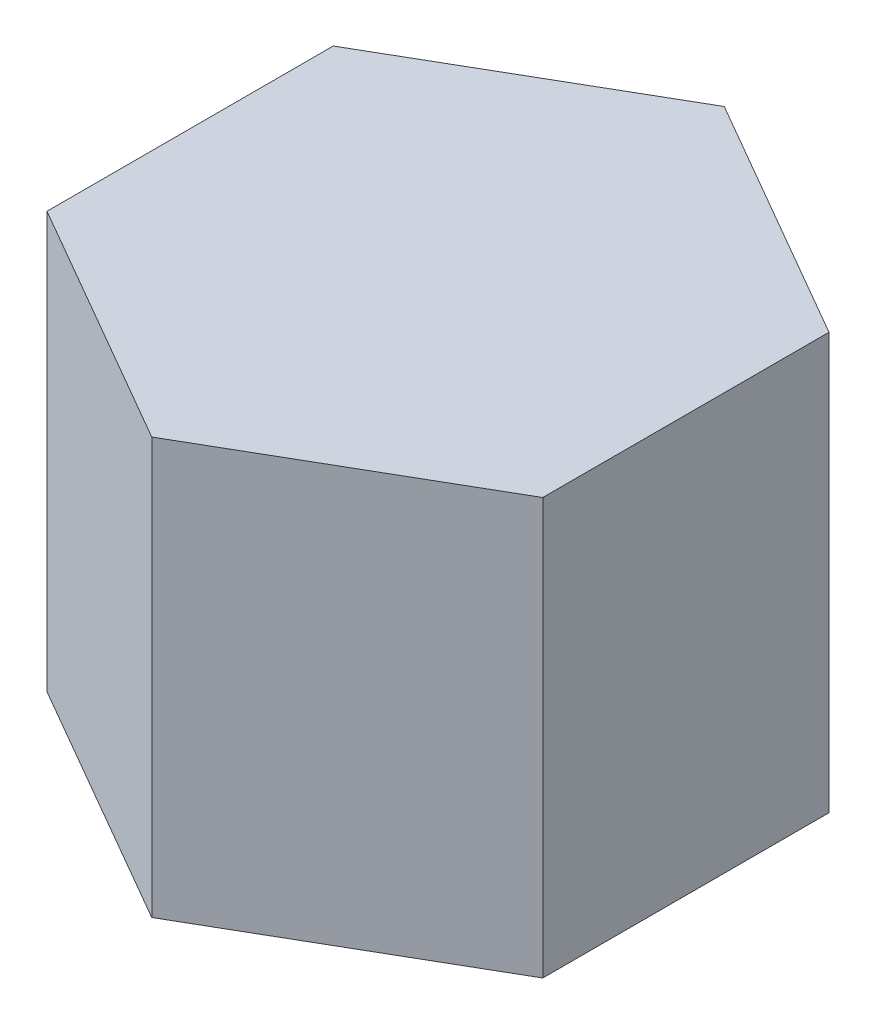
ISO-10303-21;
HEADER;
FILE_DESCRIPTION(('STEP AP214'),'2;1');
FILE_NAME('part.step','',(''),(''),'','','');
FILE_SCHEMA(('AUTOMOTIVE_DESIGN { 1 0 10303 214 1 1 1 1 }'));
ENDSEC;
DATA;
#1=APPLICATION_CONTEXT('core data for automotive mechanical design processes');
#2=APPLICATION_PROTOCOL_DEFINITION('international standard','automotive_design',2000,#1);
#3=PRODUCT_CONTEXT('',#1,'mechanical');
#4=PRODUCT('Part','Part','',(#3));
#5=PRODUCT_RELATED_PRODUCT_CATEGORY('part','',(#4));
#6=PRODUCT_DEFINITION_FORMATION('','',#4);
#7=PRODUCT_DEFINITION_CONTEXT('part definition',#1,'design');
#8=PRODUCT_DEFINITION('design','',#6,#7);
#9=PRODUCT_DEFINITION_SHAPE('','',#8);
#10=(LENGTH_UNIT() NAMED_UNIT(*) SI_UNIT(.MILLI.,.METRE.));
#11=(NAMED_UNIT(*) PLANE_ANGLE_UNIT() SI_UNIT($,.RADIAN.));
#12=(NAMED_UNIT(*) SI_UNIT($,.STERADIAN.) SOLID_ANGLE_UNIT());
#13=UNCERTAINTY_MEASURE_WITH_UNIT(LENGTH_MEASURE(1.E-05),#10,'distance_accuracy_value','');
#14=(GEOMETRIC_REPRESENTATION_CONTEXT(3) GLOBAL_UNCERTAINTY_ASSIGNED_CONTEXT((#13)) GLOBAL_UNIT_ASSIGNED_CONTEXT((#10,
#11,#12)) REPRESENTATION_CONTEXT('',''));
#15=CARTESIAN_POINT('',(0.,0.,0.));
#16=DIRECTION('',(0.,0.,1.));
#17=DIRECTION('',(1.,0.,0.));
#18=AXIS2_PLACEMENT_3D('',#15,#16,#17);
#19=CARTESIAN_POINT('',(202.839551417382,-147.556598747966,289.083895009141));
#20=DIRECTION('',(-0.499999999999943,0.,-0.866025403784471));
#21=DIRECTION('',(-0.866025403784471,0.,0.499999999999943));
#22=AXIS2_PLACEMENT_3D('',#19,#20,#21);
#23=PLANE('',#22);
#24=CARTESIAN_POINT('',(203.142660308706,-147.047793579175,288.908895009141));
#25=DIRECTION('',(-0.866025403784471,0.,0.499999999999943));
#26=VECTOR('',#25,1.);
#27=LINE('',#24,#26);
#28=CARTESIAN_POINT('',(203.142660308706,-147.047793579175,288.908895009141));
#29=VERTEX_POINT('',#28);
#30=CARTESIAN_POINT('',(202.839551417382,-147.047793579175,289.083895009141));
#31=VERTEX_POINT('',#30);
#32=EDGE_CURVE('E170',#29,#31,#27,.T.);
#33=ORIENTED_EDGE('',*,*,#32,.T.);
#34=CARTESIAN_POINT('',(202.839551417382,-147.556598747966,289.083895009141));
#35=DIRECTION('',(0.,1.,0.));
#36=VECTOR('',#35,1.);
#37=LINE('',#34,#36);
#38=CARTESIAN_POINT('',(202.839551417382,-147.556598747966,289.083895009141));
#39=VERTEX_POINT('',#38);
#40=EDGE_CURVE('E35',#39,#31,#37,.T.);
#41=ORIENTED_EDGE('',*,*,#40,.F.);
#42=CARTESIAN_POINT('',(203.142660308706,-147.556598747966,288.908895009141));
#43=DIRECTION('',(-0.866025403784471,0.,0.499999999999943));
#44=VECTOR('',#43,1.);
#45=LINE('',#42,#44);
#46=CARTESIAN_POINT('',(203.142660308706,-147.556598747966,288.908895009141));
#47=VERTEX_POINT('',#46);
#48=EDGE_CURVE('E159',#47,#39,#45,.T.);
#49=ORIENTED_EDGE('',*,*,#48,.F.);
#50=CARTESIAN_POINT('',(203.142660308706,-147.556598747966,288.908895009141));
#51=DIRECTION('',(0.,1.,0.));
#52=VECTOR('',#51,1.);
#53=LINE('',#50,#52);
#54=EDGE_CURVE('E10',#47,#29,#53,.T.);
#55=ORIENTED_EDGE('',*,*,#54,.T.);
#56=EDGE_LOOP('',(#33,#41,#49,#55));
#57=FACE_BOUND('',#56,.T.);
#58=ADVANCED_FACE('F16',(#57),#23,.F.);
#59=CARTESIAN_POINT('',(203.142660308706,-147.556598747966,291.594471220494));
#60=DIRECTION('',(-1.,0.,0.));
#61=DIRECTION('',(0.,-1.,0.));
#62=AXIS2_PLACEMENT_3D('',#59,#60,#61);
#63=PLANE('',#62);
#64=CARTESIAN_POINT('',(203.142660308706,-147.047793579175,288.558895009141));
#65=DIRECTION('',(0.,0.,1.));
#66=VECTOR('',#65,1.);
#67=LINE('',#64,#66);
#68=CARTESIAN_POINT('',(203.142660308706,-147.047793579175,288.558895009141));
#69=VERTEX_POINT('',#68);
#70=EDGE_CURVE('E167',#69,#29,#67,.T.);
#71=ORIENTED_EDGE('',*,*,#70,.T.);
#72=ORIENTED_EDGE('',*,*,#54,.F.);
#73=CARTESIAN_POINT('',(203.142660308706,-147.556598747966,288.558895009141));
#74=DIRECTION('',(0.,0.,1.));
#75=VECTOR('',#74,1.);
#76=LINE('',#73,#75);
#77=CARTESIAN_POINT('',(203.142660308706,-147.556598747966,288.558895009141));
#78=VERTEX_POINT('',#77);
#79=EDGE_CURVE('E156',#78,#47,#76,.T.);
#80=ORIENTED_EDGE('',*,*,#79,.F.);
#81=CARTESIAN_POINT('',(203.142660308706,-147.556598747966,288.558895009141));
#82=DIRECTION('',(0.,1.,0.));
#83=VECTOR('',#82,1.);
#84=LINE('',#81,#83);
#85=EDGE_CURVE('E27',#78,#69,#84,.T.);
#86=ORIENTED_EDGE('',*,*,#85,.T.);
#87=EDGE_LOOP('',(#71,#72,#80,#86));
#88=FACE_BOUND('',#87,.T.);
#89=ADVANCED_FACE('F189',(#88),#63,.F.);
#90=CARTESIAN_POINT('',(203.142660308706,-147.556598747966,288.558895009141));
#91=DIRECTION('',(-0.499999999999978,0.,0.866025403784452));
#92=DIRECTION('',(0.866025403784452,0.,0.499999999999978));
#93=AXIS2_PLACEMENT_3D('',#90,#91,#92);
#94=PLANE('',#93);
#95=CARTESIAN_POINT('',(202.839551417382,-147.047793579175,288.383895009141));
#96=DIRECTION('',(0.866025403784452,0.,0.499999999999978));
#97=VECTOR('',#96,1.);
#98=LINE('',#95,#97);
#99=CARTESIAN_POINT('',(202.839551417382,-147.047793579175,288.383895009141));
#100=VERTEX_POINT('',#99);
#101=EDGE_CURVE('E163',#100,#69,#98,.T.);
#102=ORIENTED_EDGE('',*,*,#101,.T.);
#103=ORIENTED_EDGE('',*,*,#85,.F.);
#104=CARTESIAN_POINT('',(202.839551417382,-147.556598747966,288.383895009141));
#105=DIRECTION('',(0.866025403784452,0.,0.499999999999978));
#106=VECTOR('',#105,1.);
#107=LINE('',#104,#106);
#108=CARTESIAN_POINT('',(202.839551417382,-147.556598747966,288.383895009141));
#109=VERTEX_POINT('',#108);
#110=EDGE_CURVE('E106',#109,#78,#107,.T.);
#111=ORIENTED_EDGE('',*,*,#110,.F.);
#112=CARTESIAN_POINT('',(202.839551417382,-147.556598747966,288.383895009141));
#113=DIRECTION('',(0.,1.,0.));
#114=VECTOR('',#113,1.);
#115=LINE('',#112,#114);
#116=EDGE_CURVE('E94',#109,#100,#115,.T.);
#117=ORIENTED_EDGE('',*,*,#116,.T.);
#118=EDGE_LOOP('',(#102,#103,#111,#117));
#119=FACE_BOUND('',#118,.T.);
#120=ADVANCED_FACE('F198',(#119),#94,.F.);
#121=CARTESIAN_POINT('',(202.839551417382,-147.556598747966,288.383895009141));
#122=DIRECTION('',(0.499999999999978,0.,0.866025403784452));
#123=DIRECTION('',(0.866025403784452,0.,-0.499999999999978));
#124=AXIS2_PLACEMENT_3D('',#121,#122,#123);
#125=PLANE('',#124);
#126=CARTESIAN_POINT('',(202.536442526057,-147.047793579175,288.558895009141));
#127=DIRECTION('',(0.866025403784452,0.,-0.499999999999978));
#128=VECTOR('',#127,1.);
#129=LINE('',#126,#128);
#130=CARTESIAN_POINT('',(202.536442526057,-147.047793579175,288.558895009141));
#131=VERTEX_POINT('',#130);
#132=EDGE_CURVE('E162',#131,#100,#129,.T.);
#133=ORIENTED_EDGE('',*,*,#132,.T.);
#134=ORIENTED_EDGE('',*,*,#116,.F.);
#135=CARTESIAN_POINT('',(202.536442526057,-147.556598747966,288.558895009141));
#136=DIRECTION('',(0.866025403784452,0.,-0.499999999999978));
#137=VECTOR('',#136,1.);
#138=LINE('',#135,#137);
#139=CARTESIAN_POINT('',(202.536442526057,-147.556598747966,288.558895009141));
#140=VERTEX_POINT('',#139);
#141=EDGE_CURVE('E98',#140,#109,#138,.T.);
#142=ORIENTED_EDGE('',*,*,#141,.F.);
#143=CARTESIAN_POINT('',(202.536442526057,-147.556598747966,288.558895009141));
#144=DIRECTION('',(0.,1.,0.));
#145=VECTOR('',#144,1.);
#146=LINE('',#143,#145);
#147=EDGE_CURVE('E79',#140,#131,#146,.T.);
#148=ORIENTED_EDGE('',*,*,#147,.T.);
#149=EDGE_LOOP('',(#133,#134,#142,#148));
#150=FACE_BOUND('',#149,.T.);
#151=ADVANCED_FACE('F100',(#150),#125,.F.);
#152=CARTESIAN_POINT('',(202.536442526057,-147.556598747966,291.594471220494));
#153=DIRECTION('',(1.,0.,0.));
#154=DIRECTION('',(0.,1.,0.));
#155=AXIS2_PLACEMENT_3D('',#152,#153,#154);
#156=PLANE('',#155);
#157=CARTESIAN_POINT('',(202.536442526057,-147.047793579175,288.908895009141));
#158=DIRECTION('',(0.,0.,-1.));
#159=VECTOR('',#158,1.);
#160=LINE('',#157,#159);
#161=CARTESIAN_POINT('',(202.536442526057,-147.047793579175,288.908895009141));
#162=VERTEX_POINT('',#161);
#163=EDGE_CURVE('E88',#162,#131,#160,.T.);
#164=ORIENTED_EDGE('',*,*,#163,.T.);
#165=ORIENTED_EDGE('',*,*,#147,.F.);
#166=CARTESIAN_POINT('',(202.536442526057,-147.556598747966,288.908895009141));
#167=DIRECTION('',(0.,0.,-1.));
#168=VECTOR('',#167,1.);
#169=LINE('',#166,#168);
#170=CARTESIAN_POINT('',(202.536442526057,-147.556598747966,288.908895009141));
#171=VERTEX_POINT('',#170);
#172=EDGE_CURVE('E84',#171,#140,#169,.T.);
#173=ORIENTED_EDGE('',*,*,#172,.F.);
#174=CARTESIAN_POINT('',(202.536442526057,-147.556598747966,288.908895009141));
#175=DIRECTION('',(0.,1.,0.));
#176=VECTOR('',#175,1.);
#177=LINE('',#174,#176);
#178=EDGE_CURVE('E58',#171,#162,#177,.T.);
#179=ORIENTED_EDGE('',*,*,#178,.T.);
#180=EDGE_LOOP('',(#164,#165,#173,#179));
#181=FACE_BOUND('',#180,.T.);
#182=ADVANCED_FACE('F82',(#181),#156,.F.);
#183=CARTESIAN_POINT('',(202.536442526057,-147.556598747966,288.908895009141));
#184=DIRECTION('',(0.499999999999943,0.,-0.866025403784471));
#185=DIRECTION('',(-0.866025403784471,0.,-0.499999999999943));
#186=AXIS2_PLACEMENT_3D('',#183,#184,#185);
#187=PLANE('',#186);
#188=CARTESIAN_POINT('',(202.839551417382,-147.047793579175,289.083895009141));
#189=DIRECTION('',(-0.866025403784471,0.,-0.499999999999943));
#190=VECTOR('',#189,1.);
#191=LINE('',#188,#190);
#192=EDGE_CURVE('E160',#31,#162,#191,.T.);
#193=ORIENTED_EDGE('',*,*,#192,.T.);
#194=ORIENTED_EDGE('',*,*,#178,.F.);
#195=CARTESIAN_POINT('',(202.839551417382,-147.556598747966,289.083895009141));
#196=DIRECTION('',(-0.866025403784471,0.,-0.499999999999943));
#197=VECTOR('',#196,1.);
#198=LINE('',#195,#197);
#199=EDGE_CURVE('E112',#39,#171,#198,.T.);
#200=ORIENTED_EDGE('',*,*,#199,.F.);
#201=ORIENTED_EDGE('',*,*,#40,.T.);
#202=EDGE_LOOP('',(#193,#194,#200,#201));
#203=FACE_BOUND('',#202,.T.);
#204=ADVANCED_FACE('F131',(#203),#187,.F.);
#205=CARTESIAN_POINT('',(206.491105863044,-147.556598747966,291.594471220494));
#206=DIRECTION('',(0.,1.,0.));
#207=DIRECTION('',(-1.,0.,0.));
#208=AXIS2_PLACEMENT_3D('',#205,#206,#207);
#209=PLANE('',#208);
#210=ORIENTED_EDGE('',*,*,#48,.T.);
#211=ORIENTED_EDGE('',*,*,#199,.T.);
#212=ORIENTED_EDGE('',*,*,#172,.T.);
#213=ORIENTED_EDGE('',*,*,#141,.T.);
#214=ORIENTED_EDGE('',*,*,#110,.T.);
#215=ORIENTED_EDGE('',*,*,#79,.T.);
#216=EDGE_LOOP('',(#210,#211,#212,#213,#214,#215));
#217=FACE_BOUND('',#216,.T.);
#218=ADVANCED_FACE('F111',(#217),#209,.F.);
#219=CARTESIAN_POINT('',(206.491105863044,-147.047793579175,291.594471220494));
#220=DIRECTION('',(0.,1.,0.));
#221=DIRECTION('',(-1.,0.,0.));
#222=AXIS2_PLACEMENT_3D('',#219,#220,#221);
#223=PLANE('',#222);
#224=ORIENTED_EDGE('',*,*,#32,.F.);
#225=ORIENTED_EDGE('',*,*,#70,.F.);
#226=ORIENTED_EDGE('',*,*,#101,.F.);
#227=ORIENTED_EDGE('',*,*,#132,.F.);
#228=ORIENTED_EDGE('',*,*,#163,.F.);
#229=ORIENTED_EDGE('',*,*,#192,.F.);
#230=EDGE_LOOP('',(#224,#225,#226,#227,#228,#229));
#231=FACE_BOUND('',#230,.T.);
#232=ADVANCED_FACE('F130',(#231),#223,.T.);
#233=CLOSED_SHELL('',(#58,#89,#120,#151,#182,#204,#218,#232));
#234=MANIFOLD_SOLID_BREP('B1',#233);
#235=ADVANCED_BREP_SHAPE_REPRESENTATION('',(#18,#234),#14);
#236=SHAPE_DEFINITION_REPRESENTATION(#9,#235);
ENDSEC;
END-ISO-10303-21;
